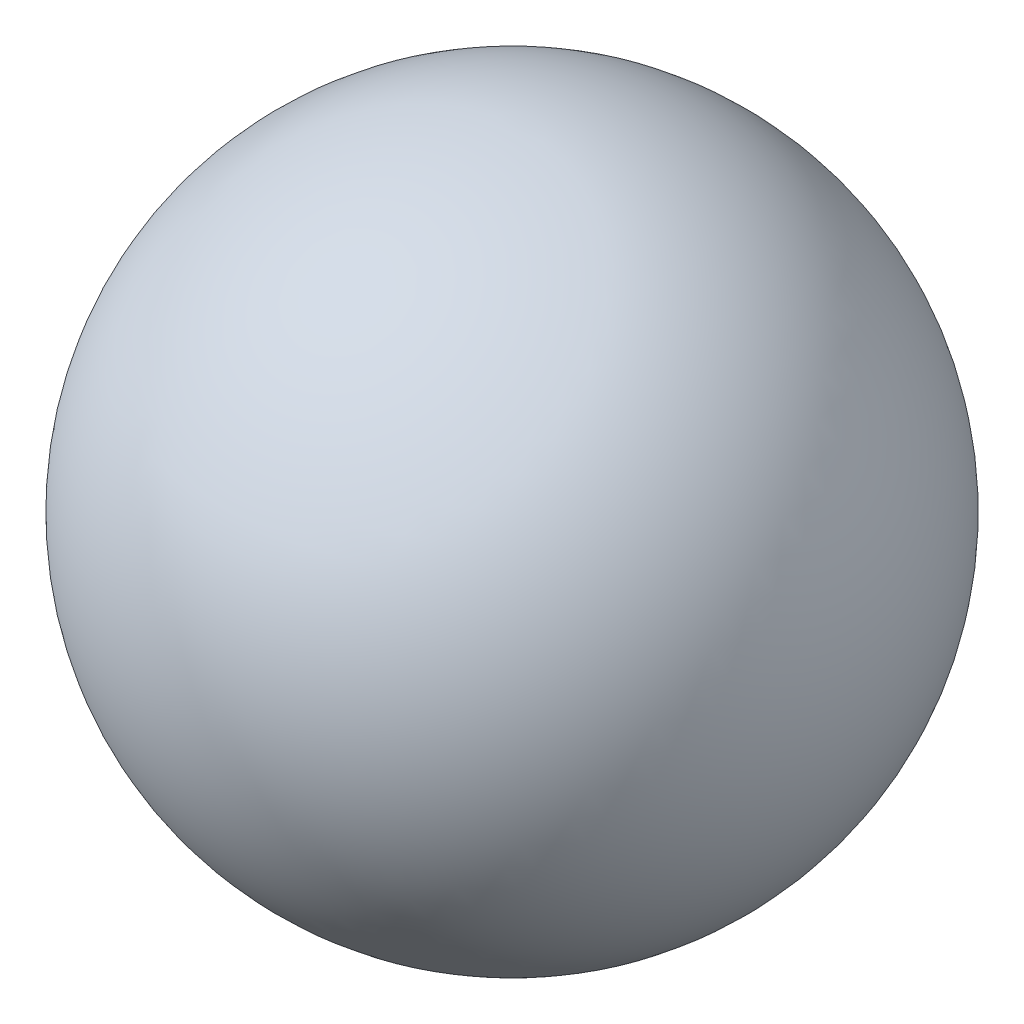
ISO-10303-21;
HEADER;
FILE_DESCRIPTION(('STEP AP214'),'2;1');
FILE_NAME('part.step','',(''),(''),'','','');
FILE_SCHEMA(('AUTOMOTIVE_DESIGN { 1 0 10303 214 1 1 1 1 }'));
ENDSEC;
DATA;
#1=APPLICATION_CONTEXT('core data for automotive mechanical design processes');
#2=APPLICATION_PROTOCOL_DEFINITION('international standard','automotive_design',2000,#1);
#3=PRODUCT_CONTEXT('',#1,'mechanical');
#4=PRODUCT('Part','Part','',(#3));
#5=PRODUCT_RELATED_PRODUCT_CATEGORY('part','',(#4));
#6=PRODUCT_DEFINITION_FORMATION('','',#4);
#7=PRODUCT_DEFINITION_CONTEXT('part definition',#1,'design');
#8=PRODUCT_DEFINITION('design','',#6,#7);
#9=PRODUCT_DEFINITION_SHAPE('','',#8);
#10=(LENGTH_UNIT() NAMED_UNIT(*) SI_UNIT(.MILLI.,.METRE.));
#11=(NAMED_UNIT(*) PLANE_ANGLE_UNIT() SI_UNIT($,.RADIAN.));
#12=(NAMED_UNIT(*) SI_UNIT($,.STERADIAN.) SOLID_ANGLE_UNIT());
#13=UNCERTAINTY_MEASURE_WITH_UNIT(LENGTH_MEASURE(1.E-05),#10,'distance_accuracy_value','');
#14=(GEOMETRIC_REPRESENTATION_CONTEXT(3) GLOBAL_UNCERTAINTY_ASSIGNED_CONTEXT((#13)) GLOBAL_UNIT_ASSIGNED_CONTEXT((#10,
#11,#12)) REPRESENTATION_CONTEXT('',''));
#15=CARTESIAN_POINT('',(0.,0.,0.));
#16=DIRECTION('',(0.,0.,1.));
#17=DIRECTION('',(1.,0.,0.));
#18=AXIS2_PLACEMENT_3D('',#15,#16,#17);
#19=CARTESIAN_POINT('',(0.,0.,0.));
#20=DIRECTION('',(0.,1.,0.));
#21=DIRECTION('',(1.,0.,0.));
#22=AXIS2_PLACEMENT_3D('',#19,#20,#21);
#23=SPHERICAL_SURFACE('',#22,30.);
#24=CARTESIAN_POINT('',(0.,30.,0.));
#25=VERTEX_POINT('',#24);
#26=VERTEX_LOOP('',#25);
#27=FACE_BOUND('',#26,.T.);
#28=ADVANCED_FACE('F30',(#27),#23,.T.);
#29=CLOSED_SHELL('',(#28));
#30=MANIFOLD_SOLID_BREP('B2',#29);
#31=ADVANCED_BREP_SHAPE_REPRESENTATION('',(#18,#30),#14);
#32=SHAPE_DEFINITION_REPRESENTATION(#9,#31);
ENDSEC;
END-ISO-10303-21;
